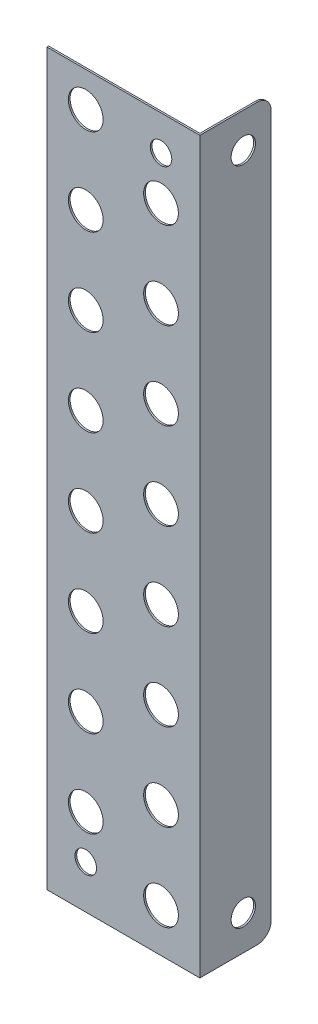
ISO-10303-21;
HEADER;
FILE_DESCRIPTION(('STEP AP214'),'2;1');
FILE_NAME('part.step','',(''),(''),'','','');
FILE_SCHEMA(('AUTOMOTIVE_DESIGN { 1 0 10303 214 1 1 1 1 }'));
ENDSEC;
DATA;
#1=APPLICATION_CONTEXT('core data for automotive mechanical design processes');
#2=APPLICATION_PROTOCOL_DEFINITION('international standard','automotive_design',2000,#1);
#3=PRODUCT_CONTEXT('',#1,'mechanical');
#4=PRODUCT('Part','Part','',(#3));
#5=PRODUCT_RELATED_PRODUCT_CATEGORY('part','',(#4));
#6=PRODUCT_DEFINITION_FORMATION('','',#4);
#7=PRODUCT_DEFINITION_CONTEXT('part definition',#1,'design');
#8=PRODUCT_DEFINITION('design','',#6,#7);
#9=PRODUCT_DEFINITION_SHAPE('','',#8);
#10=(LENGTH_UNIT() NAMED_UNIT(*) SI_UNIT(.MILLI.,.METRE.));
#11=(NAMED_UNIT(*) PLANE_ANGLE_UNIT() SI_UNIT($,.RADIAN.));
#12=(NAMED_UNIT(*) SI_UNIT($,.STERADIAN.) SOLID_ANGLE_UNIT());
#13=UNCERTAINTY_MEASURE_WITH_UNIT(LENGTH_MEASURE(1.E-05),#10,'distance_accuracy_value','');
#14=(GEOMETRIC_REPRESENTATION_CONTEXT(3) GLOBAL_UNCERTAINTY_ASSIGNED_CONTEXT((#13)) GLOBAL_UNIT_ASSIGNED_CONTEXT((#10,
#11,#12)) REPRESENTATION_CONTEXT('',''));
#15=CARTESIAN_POINT('',(0.,0.,0.));
#16=DIRECTION('',(0.,0.,1.));
#17=DIRECTION('',(1.,0.,0.));
#18=AXIS2_PLACEMENT_3D('',#15,#16,#17);
#19=CARTESIAN_POINT('',(-2.58792718984923,71.031785504095,14.8693221093527));
#20=DIRECTION('',(0.,0.,1.));
#21=DIRECTION('',(1.,0.,0.));
#22=AXIS2_PLACEMENT_3D('',#19,#20,#21);
#23=CYLINDRICAL_SURFACE('',#22,5.);
#24=CARTESIAN_POINT('',(-2.58792718984923,71.031785504095,15.3693221093527));
#25=DIRECTION('',(0.,0.,1.));
#26=DIRECTION('',(1.,0.,0.));
#27=AXIS2_PLACEMENT_3D('',#24,#25,#26);
#28=CIRCLE('',#27,5.);
#29=CARTESIAN_POINT('',(2.41207281015077,71.031785504095,15.3693221093527));
#30=VERTEX_POINT('',#29);
#31=EDGE_CURVE('E108',#30,#30,#28,.T.);
#32=ORIENTED_EDGE('',*,*,#31,.T.);
#33=EDGE_LOOP('',(#32));
#34=FACE_BOUND('',#33,.T.);
#35=CARTESIAN_POINT('',(-2.58792718984923,71.031785504095,14.8693221093527));
#36=DIRECTION('',(0.,0.,-1.));
#37=DIRECTION('',(-1.,0.,0.));
#38=AXIS2_PLACEMENT_3D('',#35,#36,#37);
#39=CIRCLE('',#38,5.);
#40=CARTESIAN_POINT('',(-7.58792718984923,71.031785504095,14.8693221093527));
#41=VERTEX_POINT('',#40);
#42=EDGE_CURVE('E215',#41,#41,#39,.F.);
#43=ORIENTED_EDGE('',*,*,#42,.F.);
#44=EDGE_LOOP('',(#43));
#45=FACE_BOUND('',#44,.T.);
#46=ADVANCED_FACE('F33',(#34,#45),#23,.F.);
#47=CARTESIAN_POINT('',(-24.2385622844602,83.531785504095,14.8693221093527));
#48=DIRECTION('',(0.,0.,1.));
#49=DIRECTION('',(1.,0.,0.));
#50=AXIS2_PLACEMENT_3D('',#47,#48,#49);
#51=CYLINDRICAL_SURFACE('',#50,5.);
#52=CARTESIAN_POINT('',(-24.2385622844602,83.531785504095,15.3693221093527));
#53=DIRECTION('',(0.,0.,1.));
#54=DIRECTION('',(1.,0.,0.));
#55=AXIS2_PLACEMENT_3D('',#52,#53,#54);
#56=CIRCLE('',#55,5.);
#57=CARTESIAN_POINT('',(-19.2385622844602,83.531785504095,15.3693221093527));
#58=VERTEX_POINT('',#57);
#59=EDGE_CURVE('E236',#58,#58,#56,.T.);
#60=ORIENTED_EDGE('',*,*,#59,.T.);
#61=EDGE_LOOP('',(#60));
#62=FACE_BOUND('',#61,.T.);
#63=CARTESIAN_POINT('',(-24.2385622844602,83.531785504095,14.8693221093527));
#64=DIRECTION('',(0.,0.,-1.));
#65=DIRECTION('',(-1.,0.,0.));
#66=AXIS2_PLACEMENT_3D('',#63,#64,#65);
#67=CIRCLE('',#66,5.);
#68=CARTESIAN_POINT('',(-29.2385622844602,83.531785504095,14.8693221093527));
#69=VERTEX_POINT('',#68);
#70=EDGE_CURVE('E212',#69,#69,#67,.F.);
#71=ORIENTED_EDGE('',*,*,#70,.F.);
#72=EDGE_LOOP('',(#71));
#73=FACE_BOUND('',#72,.T.);
#74=ADVANCED_FACE('F245',(#62,#73),#51,.F.);
#75=CARTESIAN_POINT('',(-24.2385622844602,58.531785504095,14.8693221093527));
#76=DIRECTION('',(0.,0.,1.));
#77=DIRECTION('',(1.,0.,0.));
#78=AXIS2_PLACEMENT_3D('',#75,#76,#77);
#79=CYLINDRICAL_SURFACE('',#78,5.);
#80=CARTESIAN_POINT('',(-24.2385622844602,58.531785504095,15.3693221093527));
#81=DIRECTION('',(0.,0.,1.));
#82=DIRECTION('',(1.,0.,0.));
#83=AXIS2_PLACEMENT_3D('',#80,#81,#82);
#84=CIRCLE('',#83,5.);
#85=CARTESIAN_POINT('',(-19.2385622844602,58.531785504095,15.3693221093527));
#86=VERTEX_POINT('',#85);
#87=EDGE_CURVE('E233',#86,#86,#84,.T.);
#88=ORIENTED_EDGE('',*,*,#87,.T.);
#89=EDGE_LOOP('',(#88));
#90=FACE_BOUND('',#89,.T.);
#91=CARTESIAN_POINT('',(-24.2385622844602,58.531785504095,14.8693221093527));
#92=DIRECTION('',(0.,0.,-1.));
#93=DIRECTION('',(-1.,0.,0.));
#94=AXIS2_PLACEMENT_3D('',#91,#92,#93);
#95=CIRCLE('',#94,5.);
#96=CARTESIAN_POINT('',(-29.2385622844602,58.531785504095,14.8693221093527));
#97=VERTEX_POINT('',#96);
#98=EDGE_CURVE('E209',#97,#97,#95,.F.);
#99=ORIENTED_EDGE('',*,*,#98,.F.);
#100=EDGE_LOOP('',(#99));
#101=FACE_BOUND('',#100,.T.);
#102=ADVANCED_FACE('F468',(#90,#101),#79,.F.);
#103=CARTESIAN_POINT('',(-24.2385622844602,33.531785504095,14.8693221093527));
#104=DIRECTION('',(0.,0.,1.));
#105=DIRECTION('',(1.,0.,0.));
#106=AXIS2_PLACEMENT_3D('',#103,#104,#105);
#107=CYLINDRICAL_SURFACE('',#106,5.);
#108=CARTESIAN_POINT('',(-24.2385622844602,33.531785504095,15.3693221093527));
#109=DIRECTION('',(0.,0.,1.));
#110=DIRECTION('',(1.,0.,0.));
#111=AXIS2_PLACEMENT_3D('',#108,#109,#110);
#112=CIRCLE('',#111,5.);
#113=CARTESIAN_POINT('',(-19.2385622844602,33.531785504095,15.3693221093527));
#114=VERTEX_POINT('',#113);
#115=EDGE_CURVE('E117',#114,#114,#112,.T.);
#116=ORIENTED_EDGE('',*,*,#115,.T.);
#117=EDGE_LOOP('',(#116));
#118=FACE_BOUND('',#117,.T.);
#119=CARTESIAN_POINT('',(-24.2385622844602,33.531785504095,14.8693221093527));
#120=DIRECTION('',(0.,0.,-1.));
#121=DIRECTION('',(-1.,0.,0.));
#122=AXIS2_PLACEMENT_3D('',#119,#120,#121);
#123=CIRCLE('',#122,5.);
#124=CARTESIAN_POINT('',(-29.2385622844602,33.531785504095,14.8693221093527));
#125=VERTEX_POINT('',#124);
#126=EDGE_CURVE('E206',#125,#125,#123,.F.);
#127=ORIENTED_EDGE('',*,*,#126,.F.);
#128=EDGE_LOOP('',(#127));
#129=FACE_BOUND('',#128,.T.);
#130=ADVANCED_FACE('F479',(#118,#129),#107,.F.);
#131=CARTESIAN_POINT('',(-24.2385622844602,8.53178550409502,14.8693221093527));
#132=DIRECTION('',(0.,0.,1.));
#133=DIRECTION('',(1.,0.,0.));
#134=AXIS2_PLACEMENT_3D('',#131,#132,#133);
#135=CYLINDRICAL_SURFACE('',#134,5.);
#136=CARTESIAN_POINT('',(-24.2385622844602,8.53178550409502,15.3693221093527));
#137=DIRECTION('',(0.,0.,1.));
#138=DIRECTION('',(1.,0.,0.));
#139=AXIS2_PLACEMENT_3D('',#136,#137,#138);
#140=CIRCLE('',#139,5.);
#141=CARTESIAN_POINT('',(-19.2385622844602,8.53178550409502,15.3693221093527));
#142=VERTEX_POINT('',#141);
#143=EDGE_CURVE('E120',#142,#142,#140,.T.);
#144=ORIENTED_EDGE('',*,*,#143,.T.);
#145=EDGE_LOOP('',(#144));
#146=FACE_BOUND('',#145,.T.);
#147=CARTESIAN_POINT('',(-24.2385622844602,8.53178550409502,14.8693221093527));
#148=DIRECTION('',(0.,0.,-1.));
#149=DIRECTION('',(-1.,0.,0.));
#150=AXIS2_PLACEMENT_3D('',#147,#148,#149);
#151=CIRCLE('',#150,5.);
#152=CARTESIAN_POINT('',(-29.2385622844602,8.53178550409502,14.8693221093527));
#153=VERTEX_POINT('',#152);
#154=EDGE_CURVE('E203',#153,#153,#151,.F.);
#155=ORIENTED_EDGE('',*,*,#154,.F.);
#156=EDGE_LOOP('',(#155));
#157=FACE_BOUND('',#156,.T.);
#158=ADVANCED_FACE('F490',(#146,#157),#135,.F.);
#159=CARTESIAN_POINT('',(-24.2385622844602,-16.468214495905,14.8693221093527));
#160=DIRECTION('',(0.,0.,1.));
#161=DIRECTION('',(1.,0.,0.));
#162=AXIS2_PLACEMENT_3D('',#159,#160,#161);
#163=CYLINDRICAL_SURFACE('',#162,5.);
#164=CARTESIAN_POINT('',(-24.2385622844602,-16.468214495905,15.3693221093527));
#165=DIRECTION('',(0.,0.,1.));
#166=DIRECTION('',(1.,0.,0.));
#167=AXIS2_PLACEMENT_3D('',#164,#165,#166);
#168=CIRCLE('',#167,5.);
#169=CARTESIAN_POINT('',(-19.2385622844602,-16.468214495905,15.3693221093527));
#170=VERTEX_POINT('',#169);
#171=EDGE_CURVE('E123',#170,#170,#168,.T.);
#172=ORIENTED_EDGE('',*,*,#171,.T.);
#173=EDGE_LOOP('',(#172));
#174=FACE_BOUND('',#173,.T.);
#175=CARTESIAN_POINT('',(-24.2385622844602,-16.468214495905,14.8693221093527));
#176=DIRECTION('',(0.,0.,-1.));
#177=DIRECTION('',(-1.,0.,0.));
#178=AXIS2_PLACEMENT_3D('',#175,#176,#177);
#179=CIRCLE('',#178,5.);
#180=CARTESIAN_POINT('',(-29.2385622844602,-16.468214495905,14.8693221093527));
#181=VERTEX_POINT('',#180);
#182=EDGE_CURVE('E200',#181,#181,#179,.F.);
#183=ORIENTED_EDGE('',*,*,#182,.F.);
#184=EDGE_LOOP('',(#183));
#185=FACE_BOUND('',#184,.T.);
#186=ADVANCED_FACE('F501',(#174,#185),#163,.F.);
#187=CARTESIAN_POINT('',(-24.2385622844602,-41.468214495905,14.8693221093527));
#188=DIRECTION('',(0.,0.,1.));
#189=DIRECTION('',(1.,0.,0.));
#190=AXIS2_PLACEMENT_3D('',#187,#188,#189);
#191=CYLINDRICAL_SURFACE('',#190,5.);
#192=CARTESIAN_POINT('',(-24.2385622844602,-41.468214495905,15.3693221093527));
#193=DIRECTION('',(0.,0.,1.));
#194=DIRECTION('',(1.,0.,0.));
#195=AXIS2_PLACEMENT_3D('',#192,#193,#194);
#196=CIRCLE('',#195,5.);
#197=CARTESIAN_POINT('',(-19.2385622844602,-41.468214495905,15.3693221093527));
#198=VERTEX_POINT('',#197);
#199=EDGE_CURVE('E126',#198,#198,#196,.T.);
#200=ORIENTED_EDGE('',*,*,#199,.T.);
#201=EDGE_LOOP('',(#200));
#202=FACE_BOUND('',#201,.T.);
#203=CARTESIAN_POINT('',(-24.2385622844602,-41.468214495905,14.8693221093527));
#204=DIRECTION('',(0.,0.,-1.));
#205=DIRECTION('',(-1.,0.,0.));
#206=AXIS2_PLACEMENT_3D('',#203,#204,#205);
#207=CIRCLE('',#206,5.);
#208=CARTESIAN_POINT('',(-29.2385622844602,-41.468214495905,14.8693221093527));
#209=VERTEX_POINT('',#208);
#210=EDGE_CURVE('E197',#209,#209,#207,.F.);
#211=ORIENTED_EDGE('',*,*,#210,.F.);
#212=EDGE_LOOP('',(#211));
#213=FACE_BOUND('',#212,.T.);
#214=ADVANCED_FACE('F295',(#202,#213),#191,.F.);
#215=CARTESIAN_POINT('',(-24.2385622844602,-66.468214495905,14.8693221093527));
#216=DIRECTION('',(0.,0.,1.));
#217=DIRECTION('',(1.,0.,0.));
#218=AXIS2_PLACEMENT_3D('',#215,#216,#217);
#219=CYLINDRICAL_SURFACE('',#218,5.);
#220=CARTESIAN_POINT('',(-24.2385622844602,-66.468214495905,15.3693221093527));
#221=DIRECTION('',(0.,0.,1.));
#222=DIRECTION('',(1.,0.,0.));
#223=AXIS2_PLACEMENT_3D('',#220,#221,#222);
#224=CIRCLE('',#223,5.);
#225=CARTESIAN_POINT('',(-19.2385622844602,-66.468214495905,15.3693221093527));
#226=VERTEX_POINT('',#225);
#227=EDGE_CURVE('E129',#226,#226,#224,.T.);
#228=ORIENTED_EDGE('',*,*,#227,.T.);
#229=EDGE_LOOP('',(#228));
#230=FACE_BOUND('',#229,.T.);
#231=CARTESIAN_POINT('',(-24.2385622844602,-66.468214495905,14.8693221093527));
#232=DIRECTION('',(0.,0.,-1.));
#233=DIRECTION('',(-1.,0.,0.));
#234=AXIS2_PLACEMENT_3D('',#231,#232,#233);
#235=CIRCLE('',#234,5.);
#236=CARTESIAN_POINT('',(-29.2385622844602,-66.468214495905,14.8693221093527));
#237=VERTEX_POINT('',#236);
#238=EDGE_CURVE('E194',#237,#237,#235,.F.);
#239=ORIENTED_EDGE('',*,*,#238,.F.);
#240=EDGE_LOOP('',(#239));
#241=FACE_BOUND('',#240,.T.);
#242=ADVANCED_FACE('F285',(#230,#241),#219,.F.);
#243=CARTESIAN_POINT('',(-24.2385622844602,-91.468214495905,14.8693221093527));
#244=DIRECTION('',(0.,0.,1.));
#245=DIRECTION('',(1.,0.,0.));
#246=AXIS2_PLACEMENT_3D('',#243,#244,#245);
#247=CYLINDRICAL_SURFACE('',#246,5.);
#248=CARTESIAN_POINT('',(-24.2385622844602,-91.468214495905,15.3693221093527));
#249=DIRECTION('',(0.,0.,1.));
#250=DIRECTION('',(1.,0.,0.));
#251=AXIS2_PLACEMENT_3D('',#248,#249,#250);
#252=CIRCLE('',#251,5.);
#253=CARTESIAN_POINT('',(-19.2385622844602,-91.468214495905,15.3693221093527));
#254=VERTEX_POINT('',#253);
#255=EDGE_CURVE('E132',#254,#254,#252,.T.);
#256=ORIENTED_EDGE('',*,*,#255,.T.);
#257=EDGE_LOOP('',(#256));
#258=FACE_BOUND('',#257,.T.);
#259=CARTESIAN_POINT('',(-24.2385622844602,-91.468214495905,14.8693221093527));
#260=DIRECTION('',(0.,0.,-1.));
#261=DIRECTION('',(-1.,0.,0.));
#262=AXIS2_PLACEMENT_3D('',#259,#260,#261);
#263=CIRCLE('',#262,5.);
#264=CARTESIAN_POINT('',(-29.2385622844602,-91.468214495905,14.8693221093527));
#265=VERTEX_POINT('',#264);
#266=EDGE_CURVE('E191',#265,#265,#263,.F.);
#267=ORIENTED_EDGE('',*,*,#266,.F.);
#268=EDGE_LOOP('',(#267));
#269=FACE_BOUND('',#268,.T.);
#270=ADVANCED_FACE('F282',(#258,#269),#247,.F.);
#271=CARTESIAN_POINT('',(-2.58792718984923,46.031785504095,14.8693221093527));
#272=DIRECTION('',(0.,0.,1.));
#273=DIRECTION('',(1.,0.,0.));
#274=AXIS2_PLACEMENT_3D('',#271,#272,#273);
#275=CYLINDRICAL_SURFACE('',#274,5.);
#276=CARTESIAN_POINT('',(-2.58792718984923,46.031785504095,15.3693221093527));
#277=DIRECTION('',(0.,0.,1.));
#278=DIRECTION('',(1.,0.,0.));
#279=AXIS2_PLACEMENT_3D('',#276,#277,#278);
#280=CIRCLE('',#279,5.);
#281=CARTESIAN_POINT('',(2.41207281015077,46.031785504095,15.3693221093527));
#282=VERTEX_POINT('',#281);
#283=EDGE_CURVE('E228',#282,#282,#280,.T.);
#284=ORIENTED_EDGE('',*,*,#283,.T.);
#285=EDGE_LOOP('',(#284));
#286=FACE_BOUND('',#285,.T.);
#287=CARTESIAN_POINT('',(-2.58792718984923,46.031785504095,14.8693221093527));
#288=DIRECTION('',(0.,0.,-1.));
#289=DIRECTION('',(-1.,0.,0.));
#290=AXIS2_PLACEMENT_3D('',#287,#288,#289);
#291=CIRCLE('',#290,5.);
#292=CARTESIAN_POINT('',(-7.58792718984923,46.031785504095,14.8693221093527));
#293=VERTEX_POINT('',#292);
#294=EDGE_CURVE('E188',#293,#293,#291,.F.);
#295=ORIENTED_EDGE('',*,*,#294,.F.);
#296=EDGE_LOOP('',(#295));
#297=FACE_BOUND('',#296,.T.);
#298=ADVANCED_FACE('F284',(#286,#297),#275,.F.);
#299=CARTESIAN_POINT('',(-2.58792718984923,21.031785504095,14.8693221093527));
#300=DIRECTION('',(0.,0.,1.));
#301=DIRECTION('',(1.,0.,0.));
#302=AXIS2_PLACEMENT_3D('',#299,#300,#301);
#303=CYLINDRICAL_SURFACE('',#302,5.);
#304=CARTESIAN_POINT('',(-2.58792718984923,21.031785504095,15.3693221093527));
#305=DIRECTION('',(0.,0.,1.));
#306=DIRECTION('',(1.,0.,0.));
#307=AXIS2_PLACEMENT_3D('',#304,#305,#306);
#308=CIRCLE('',#307,5.);
#309=CARTESIAN_POINT('',(2.41207281015077,21.031785504095,15.3693221093527));
#310=VERTEX_POINT('',#309);
#311=EDGE_CURVE('E135',#310,#310,#308,.T.);
#312=ORIENTED_EDGE('',*,*,#311,.T.);
#313=EDGE_LOOP('',(#312));
#314=FACE_BOUND('',#313,.T.);
#315=CARTESIAN_POINT('',(-2.58792718984923,21.031785504095,14.8693221093527));
#316=DIRECTION('',(0.,0.,-1.));
#317=DIRECTION('',(-1.,0.,0.));
#318=AXIS2_PLACEMENT_3D('',#315,#316,#317);
#319=CIRCLE('',#318,5.);
#320=CARTESIAN_POINT('',(-7.58792718984923,21.031785504095,14.8693221093527));
#321=VERTEX_POINT('',#320);
#322=EDGE_CURVE('E185',#321,#321,#319,.F.);
#323=ORIENTED_EDGE('',*,*,#322,.F.);
#324=EDGE_LOOP('',(#323));
#325=FACE_BOUND('',#324,.T.);
#326=ADVANCED_FACE('F292',(#314,#325),#303,.F.);
#327=CARTESIAN_POINT('',(-2.58792718984923,-3.96821449590497,14.8693221093527));
#328=DIRECTION('',(0.,0.,1.));
#329=DIRECTION('',(1.,0.,0.));
#330=AXIS2_PLACEMENT_3D('',#327,#328,#329);
#331=CYLINDRICAL_SURFACE('',#330,5.);
#332=CARTESIAN_POINT('',(-2.58792718984923,-3.96821449590497,15.3693221093527));
#333=DIRECTION('',(0.,0.,1.));
#334=DIRECTION('',(1.,0.,0.));
#335=AXIS2_PLACEMENT_3D('',#332,#333,#334);
#336=CIRCLE('',#335,5.);
#337=CARTESIAN_POINT('',(2.41207281015077,-3.96821449590497,15.3693221093527));
#338=VERTEX_POINT('',#337);
#339=EDGE_CURVE('E138',#338,#338,#336,.T.);
#340=ORIENTED_EDGE('',*,*,#339,.T.);
#341=EDGE_LOOP('',(#340));
#342=FACE_BOUND('',#341,.T.);
#343=CARTESIAN_POINT('',(-2.58792718984923,-3.96821449590497,14.8693221093527));
#344=DIRECTION('',(0.,0.,-1.));
#345=DIRECTION('',(-1.,0.,0.));
#346=AXIS2_PLACEMENT_3D('',#343,#344,#345);
#347=CIRCLE('',#346,5.);
#348=CARTESIAN_POINT('',(-7.58792718984923,-3.96821449590497,14.8693221093527));
#349=VERTEX_POINT('',#348);
#350=EDGE_CURVE('E182',#349,#349,#347,.F.);
#351=ORIENTED_EDGE('',*,*,#350,.F.);
#352=EDGE_LOOP('',(#351));
#353=FACE_BOUND('',#352,.T.);
#354=ADVANCED_FACE('F302',(#342,#353),#331,.F.);
#355=CARTESIAN_POINT('',(-2.58792718984923,-28.968214495905,14.8693221093527));
#356=DIRECTION('',(0.,0.,1.));
#357=DIRECTION('',(1.,0.,0.));
#358=AXIS2_PLACEMENT_3D('',#355,#356,#357);
#359=CYLINDRICAL_SURFACE('',#358,5.);
#360=CARTESIAN_POINT('',(-2.58792718984923,-28.968214495905,15.3693221093527));
#361=DIRECTION('',(0.,0.,1.));
#362=DIRECTION('',(1.,0.,0.));
#363=AXIS2_PLACEMENT_3D('',#360,#361,#362);
#364=CIRCLE('',#363,5.);
#365=CARTESIAN_POINT('',(2.41207281015077,-28.968214495905,15.3693221093527));
#366=VERTEX_POINT('',#365);
#367=EDGE_CURVE('E141',#366,#366,#364,.T.);
#368=ORIENTED_EDGE('',*,*,#367,.T.);
#369=EDGE_LOOP('',(#368));
#370=FACE_BOUND('',#369,.T.);
#371=CARTESIAN_POINT('',(-2.58792718984923,-28.968214495905,14.8693221093527));
#372=DIRECTION('',(0.,0.,-1.));
#373=DIRECTION('',(-1.,0.,0.));
#374=AXIS2_PLACEMENT_3D('',#371,#372,#373);
#375=CIRCLE('',#374,5.);
#376=CARTESIAN_POINT('',(-7.58792718984923,-28.968214495905,14.8693221093527));
#377=VERTEX_POINT('',#376);
#378=EDGE_CURVE('E179',#377,#377,#375,.F.);
#379=ORIENTED_EDGE('',*,*,#378,.F.);
#380=EDGE_LOOP('',(#379));
#381=FACE_BOUND('',#380,.T.);
#382=ADVANCED_FACE('F306',(#370,#381),#359,.F.);
#383=CARTESIAN_POINT('',(-2.58792718984923,-53.968214495905,14.8693221093527));
#384=DIRECTION('',(0.,0.,1.));
#385=DIRECTION('',(1.,0.,0.));
#386=AXIS2_PLACEMENT_3D('',#383,#384,#385);
#387=CYLINDRICAL_SURFACE('',#386,5.);
#388=CARTESIAN_POINT('',(-2.58792718984923,-53.968214495905,15.3693221093527));
#389=DIRECTION('',(0.,0.,1.));
#390=DIRECTION('',(1.,0.,0.));
#391=AXIS2_PLACEMENT_3D('',#388,#389,#390);
#392=CIRCLE('',#391,5.);
#393=CARTESIAN_POINT('',(2.41207281015077,-53.968214495905,15.3693221093527));
#394=VERTEX_POINT('',#393);
#395=EDGE_CURVE('E144',#394,#394,#392,.T.);
#396=ORIENTED_EDGE('',*,*,#395,.T.);
#397=EDGE_LOOP('',(#396));
#398=FACE_BOUND('',#397,.T.);
#399=CARTESIAN_POINT('',(-2.58792718984923,-53.968214495905,14.8693221093527));
#400=DIRECTION('',(0.,0.,-1.));
#401=DIRECTION('',(-1.,0.,0.));
#402=AXIS2_PLACEMENT_3D('',#399,#400,#401);
#403=CIRCLE('',#402,5.);
#404=CARTESIAN_POINT('',(-7.58792718984923,-53.968214495905,14.8693221093527));
#405=VERTEX_POINT('',#404);
#406=EDGE_CURVE('E171',#405,#405,#403,.F.);
#407=ORIENTED_EDGE('',*,*,#406,.F.);
#408=EDGE_LOOP('',(#407));
#409=FACE_BOUND('',#408,.T.);
#410=ADVANCED_FACE('F310',(#398,#409),#387,.F.);
#411=CARTESIAN_POINT('',(-2.58792718984923,-78.968214495905,14.8693221093527));
#412=DIRECTION('',(0.,0.,1.));
#413=DIRECTION('',(1.,0.,0.));
#414=AXIS2_PLACEMENT_3D('',#411,#412,#413);
#415=CYLINDRICAL_SURFACE('',#414,5.);
#416=CARTESIAN_POINT('',(-2.58792718984923,-78.968214495905,15.3693221093527));
#417=DIRECTION('',(0.,0.,1.));
#418=DIRECTION('',(1.,0.,0.));
#419=AXIS2_PLACEMENT_3D('',#416,#417,#418);
#420=CIRCLE('',#419,5.);
#421=CARTESIAN_POINT('',(2.41207281015077,-78.968214495905,15.3693221093527));
#422=VERTEX_POINT('',#421);
#423=EDGE_CURVE('E42',#422,#422,#420,.T.);
#424=ORIENTED_EDGE('',*,*,#423,.T.);
#425=EDGE_LOOP('',(#424));
#426=FACE_BOUND('',#425,.T.);
#427=CARTESIAN_POINT('',(-2.58792718984923,-78.968214495905,14.8693221093527));
#428=DIRECTION('',(0.,0.,-1.));
#429=DIRECTION('',(-1.,0.,0.));
#430=AXIS2_PLACEMENT_3D('',#427,#428,#429);
#431=CIRCLE('',#430,5.);
#432=CARTESIAN_POINT('',(-7.58792718984923,-78.968214495905,14.8693221093527));
#433=VERTEX_POINT('',#432);
#434=EDGE_CURVE('E167',#433,#433,#431,.F.);
#435=ORIENTED_EDGE('',*,*,#434,.F.);
#436=EDGE_LOOP('',(#435));
#437=FACE_BOUND('',#436,.T.);
#438=ADVANCED_FACE('F149',(#426,#437),#415,.F.);
#439=CARTESIAN_POINT('',(-2.58792718984923,-103.968214495905,14.8693221093527));
#440=DIRECTION('',(0.,0.,1.));
#441=DIRECTION('',(1.,0.,0.));
#442=AXIS2_PLACEMENT_3D('',#439,#440,#441);
#443=CYLINDRICAL_SURFACE('',#442,5.);
#444=CARTESIAN_POINT('',(-2.58792718984923,-103.968214495905,15.3693221093527));
#445=DIRECTION('',(0.,0.,1.));
#446=DIRECTION('',(1.,0.,0.));
#447=AXIS2_PLACEMENT_3D('',#444,#445,#446);
#448=CIRCLE('',#447,5.);
#449=CARTESIAN_POINT('',(2.41207281015077,-103.968214495905,15.3693221093527));
#450=VERTEX_POINT('',#449);
#451=EDGE_CURVE('E11',#450,#450,#448,.T.);
#452=ORIENTED_EDGE('',*,*,#451,.T.);
#453=EDGE_LOOP('',(#452));
#454=FACE_BOUND('',#453,.T.);
#455=CARTESIAN_POINT('',(-2.58792718984923,-103.968214495905,14.8693221093527));
#456=DIRECTION('',(0.,0.,-1.));
#457=DIRECTION('',(-1.,0.,0.));
#458=AXIS2_PLACEMENT_3D('',#455,#456,#457);
#459=CIRCLE('',#458,5.);
#460=CARTESIAN_POINT('',(-7.58792718984923,-103.968214495905,14.8693221093527));
#461=VERTEX_POINT('',#460);
#462=EDGE_CURVE('E165',#461,#461,#459,.F.);
#463=ORIENTED_EDGE('',*,*,#462,.F.);
#464=EDGE_LOOP('',(#463));
#465=FACE_BOUND('',#464,.T.);
#466=ADVANCED_FACE('F35',(#454,#465),#443,.F.);
#467=CARTESIAN_POINT('',(-13.4132447371547,-11.468214495905,14.8693221093527));
#468=DIRECTION('',(0.,0.,-1.));
#469=DIRECTION('',(-1.,0.,0.));
#470=AXIS2_PLACEMENT_3D('',#467,#468,#469);
#471=PLANE('',#470);
#472=DIRECTION('',(0.,1.,0.));
#473=VECTOR('',#472,1.);
#474=CARTESIAN_POINT('',(8.08675526284528,-11.468214495905,14.8693221093527));
#475=LINE('',#474,#473);
#476=CARTESIAN_POINT('',(8.08675526284528,-116.468214495905,14.8693221093527));
#477=VERTEX_POINT('',#476);
#478=CARTESIAN_POINT('',(8.08675526284528,93.531785504095,14.8693221093527));
#479=VERTEX_POINT('',#478);
#480=EDGE_CURVE('E168',#477,#479,#475,.T.);
#481=ORIENTED_EDGE('',*,*,#480,.F.);
#482=DIRECTION('',(1.,0.,0.));
#483=VECTOR('',#482,1.);
#484=CARTESIAN_POINT('',(-35.4132447371547,-116.468214495905,14.8693221093527));
#485=LINE('',#484,#483);
#486=CARTESIAN_POINT('',(-35.4132447371547,-116.468214495905,14.8693221093527));
#487=VERTEX_POINT('',#486);
#488=EDGE_CURVE('E110',#487,#477,#485,.T.);
#489=ORIENTED_EDGE('',*,*,#488,.F.);
#490=DIRECTION('',(0.,-1.,0.));
#491=VECTOR('',#490,1.);
#492=CARTESIAN_POINT('',(-35.4132447371547,-116.468214495905,14.8693221093527));
#493=LINE('',#492,#491);
#494=CARTESIAN_POINT('',(-35.4132447371547,93.531785504095,14.8693221093527));
#495=VERTEX_POINT('',#494);
#496=EDGE_CURVE('E107',#495,#487,#493,.T.);
#497=ORIENTED_EDGE('',*,*,#496,.F.);
#498=DIRECTION('',(-1.,0.,0.));
#499=VECTOR('',#498,1.);
#500=CARTESIAN_POINT('',(-35.4132447371547,93.531785504095,14.8693221093527));
#501=LINE('',#500,#499);
#502=EDGE_CURVE('E62',#479,#495,#501,.T.);
#503=ORIENTED_EDGE('',*,*,#502,.F.);
#504=EDGE_LOOP('',(#481,#489,#497,#503));
#505=FACE_BOUND('',#504,.T.);
#506=CARTESIAN_POINT('',(-24.2385622844602,-103.968214495905,14.8693221093527));
#507=DIRECTION('',(0.,0.,-1.));
#508=DIRECTION('',(-1.,0.,0.));
#509=AXIS2_PLACEMENT_3D('',#506,#507,#508);
#510=CIRCLE('',#509,3.1);
#511=CARTESIAN_POINT('',(-27.3385622844602,-103.968214495905,14.8693221093527));
#512=VERTEX_POINT('',#511);
#513=EDGE_CURVE('E218',#512,#512,#510,.T.);
#514=ORIENTED_EDGE('',*,*,#513,.F.);
#515=EDGE_LOOP('',(#514));
#516=FACE_BOUND('',#515,.T.);
#517=CARTESIAN_POINT('',(-2.58792718984923,83.5317855040951,14.8693221093527));
#518=DIRECTION('',(0.,0.,-1.));
#519=DIRECTION('',(-1.,0.,0.));
#520=AXIS2_PLACEMENT_3D('',#517,#518,#519);
#521=CIRCLE('',#520,3.1);
#522=CARTESIAN_POINT('',(-5.68792718984923,83.5317855040951,14.8693221093527));
#523=VERTEX_POINT('',#522);
#524=EDGE_CURVE('E222',#523,#523,#521,.T.);
#525=ORIENTED_EDGE('',*,*,#524,.F.);
#526=EDGE_LOOP('',(#525));
#527=FACE_BOUND('',#526,.T.);
#528=ORIENTED_EDGE('',*,*,#42,.T.);
#529=EDGE_LOOP('',(#528));
#530=FACE_BOUND('',#529,.T.);
#531=ORIENTED_EDGE('',*,*,#70,.T.);
#532=EDGE_LOOP('',(#531));
#533=FACE_BOUND('',#532,.T.);
#534=ORIENTED_EDGE('',*,*,#294,.T.);
#535=EDGE_LOOP('',(#534));
#536=FACE_BOUND('',#535,.T.);
#537=ORIENTED_EDGE('',*,*,#98,.T.);
#538=EDGE_LOOP('',(#537));
#539=FACE_BOUND('',#538,.T.);
#540=ORIENTED_EDGE('',*,*,#322,.T.);
#541=EDGE_LOOP('',(#540));
#542=FACE_BOUND('',#541,.T.);
#543=ORIENTED_EDGE('',*,*,#126,.T.);
#544=EDGE_LOOP('',(#543));
#545=FACE_BOUND('',#544,.T.);
#546=ORIENTED_EDGE('',*,*,#350,.T.);
#547=EDGE_LOOP('',(#546));
#548=FACE_BOUND('',#547,.T.);
#549=ORIENTED_EDGE('',*,*,#154,.T.);
#550=EDGE_LOOP('',(#549));
#551=FACE_BOUND('',#550,.T.);
#552=ORIENTED_EDGE('',*,*,#378,.T.);
#553=EDGE_LOOP('',(#552));
#554=FACE_BOUND('',#553,.T.);
#555=ORIENTED_EDGE('',*,*,#182,.T.);
#556=EDGE_LOOP('',(#555));
#557=FACE_BOUND('',#556,.T.);
#558=ORIENTED_EDGE('',*,*,#406,.T.);
#559=EDGE_LOOP('',(#558));
#560=FACE_BOUND('',#559,.T.);
#561=ORIENTED_EDGE('',*,*,#210,.T.);
#562=EDGE_LOOP('',(#561));
#563=FACE_BOUND('',#562,.T.);
#564=ORIENTED_EDGE('',*,*,#434,.T.);
#565=EDGE_LOOP('',(#564));
#566=FACE_BOUND('',#565,.T.);
#567=ORIENTED_EDGE('',*,*,#238,.T.);
#568=EDGE_LOOP('',(#567));
#569=FACE_BOUND('',#568,.T.);
#570=ORIENTED_EDGE('',*,*,#462,.T.);
#571=EDGE_LOOP('',(#570));
#572=FACE_BOUND('',#571,.T.);
#573=ORIENTED_EDGE('',*,*,#266,.T.);
#574=EDGE_LOOP('',(#573));
#575=FACE_BOUND('',#574,.T.);
#576=ADVANCED_FACE('F162',(#505,#516,#527,#530,#533,#536,#539,#542,#545,#548,#551,#554,#557,
#560,#563,#566,#569,#572,#575),#471,.T.);
#577=CARTESIAN_POINT('',(8.58675526284528,-116.468214495905,15.3693221093527));
#578=DIRECTION('',(-1.,0.,0.));
#579=DIRECTION('',(0.,0.,1.));
#580=AXIS2_PLACEMENT_3D('',#577,#578,#579);
#581=PLANE('',#580);
#582=DIRECTION('',(0.,0.,-1.));
#583=VECTOR('',#582,1.);
#584=CARTESIAN_POINT('',(8.58675526284528,-116.468214495905,15.3693221093527));
#585=LINE('',#584,#583);
#586=CARTESIAN_POINT('',(8.58675526284528,-116.468214495905,15.3693221093527));
#587=VERTEX_POINT('',#586);
#588=CARTESIAN_POINT('',(8.58675526284528,-116.468214495905,-1.13067789064725));
#589=VERTEX_POINT('',#588);
#590=EDGE_CURVE('E102',#587,#589,#585,.T.);
#591=ORIENTED_EDGE('',*,*,#590,.T.);
#592=CARTESIAN_POINT('',(8.58675526284528,-112.468214495905,-1.13067789064727));
#593=DIRECTION('',(1.,0.,0.));
#594=DIRECTION('',(0.,0.,-1.));
#595=AXIS2_PLACEMENT_3D('',#592,#593,#594);
#596=CIRCLE('',#595,4.);
#597=CARTESIAN_POINT('',(8.58675526284528,-112.468214495905,-5.13067789064728));
#598=VERTEX_POINT('',#597);
#599=EDGE_CURVE('E664',#589,#598,#596,.T.);
#600=ORIENTED_EDGE('',*,*,#599,.T.);
#601=DIRECTION('',(0.,1.,0.));
#602=VECTOR('',#601,1.);
#603=CARTESIAN_POINT('',(8.58675526284528,-112.468214495905,-5.13067789064727));
#604=LINE('',#603,#602);
#605=CARTESIAN_POINT('',(8.58675526284528,89.531785504095,-5.13067789064727));
#606=VERTEX_POINT('',#605);
#607=EDGE_CURVE('E683',#598,#606,#604,.T.);
#608=ORIENTED_EDGE('',*,*,#607,.T.);
#609=CARTESIAN_POINT('',(8.58675526284528,89.531785504095,-1.13067789064727));
#610=DIRECTION('',(1.,0.,0.));
#611=DIRECTION('',(0.,0.,1.));
#612=AXIS2_PLACEMENT_3D('',#609,#610,#611);
#613=CIRCLE('',#612,4.);
#614=CARTESIAN_POINT('',(8.58675526284528,93.531785504095,-1.13067789064725));
#615=VERTEX_POINT('',#614);
#616=EDGE_CURVE('E669',#606,#615,#613,.T.);
#617=ORIENTED_EDGE('',*,*,#616,.T.);
#618=DIRECTION('',(0.,0.,-1.));
#619=VECTOR('',#618,1.);
#620=CARTESIAN_POINT('',(8.58675526284528,93.531785504095,15.3693221093527));
#621=LINE('',#620,#619);
#622=CARTESIAN_POINT('',(8.58675526284528,93.531785504095,15.3693221093527));
#623=VERTEX_POINT('',#622);
#624=EDGE_CURVE('E96',#623,#615,#621,.T.);
#625=ORIENTED_EDGE('',*,*,#624,.F.);
#626=DIRECTION('',(0.,1.,0.));
#627=VECTOR('',#626,1.);
#628=CARTESIAN_POINT('',(8.58675526284528,-116.468214495905,15.3693221093527));
#629=LINE('',#628,#627);
#630=EDGE_CURVE('E88',#587,#623,#629,.T.);
#631=ORIENTED_EDGE('',*,*,#630,.F.);
#632=EDGE_LOOP('',(#591,#600,#608,#617,#625,#631));
#633=FACE_BOUND('',#632,.T.);
#634=CARTESIAN_POINT('',(8.58675526284528,83.5317855040879,2.86932210935019));
#635=DIRECTION('',(1.,0.,0.));
#636=DIRECTION('',(0.,0.,1.));
#637=AXIS2_PLACEMENT_3D('',#634,#635,#636);
#638=CIRCLE('',#637,3.5);
#639=CARTESIAN_POINT('',(8.58675526284528,83.5317855040879,6.36932210935019));
#640=VERTEX_POINT('',#639);
#641=EDGE_CURVE('E655',#640,#640,#638,.T.);
#642=ORIENTED_EDGE('',*,*,#641,.F.);
#643=EDGE_LOOP('',(#642));
#644=FACE_BOUND('',#643,.T.);
#645=CARTESIAN_POINT('',(8.58675526284528,-106.468214495898,2.86932210935019));
#646=DIRECTION('',(1.,0.,0.));
#647=DIRECTION('',(0.,0.,-1.));
#648=AXIS2_PLACEMENT_3D('',#645,#646,#647);
#649=CIRCLE('',#648,3.5);
#650=CARTESIAN_POINT('',(8.58675526284528,-106.468214495898,-0.630677890649813));
#651=VERTEX_POINT('',#650);
#652=EDGE_CURVE('E658',#651,#651,#649,.T.);
#653=ORIENTED_EDGE('',*,*,#652,.F.);
#654=EDGE_LOOP('',(#653));
#655=FACE_BOUND('',#654,.T.);
#656=ADVANCED_FACE('F251',(#633,#644,#655),#581,.F.);
#657=CARTESIAN_POINT('',(-35.4132447371547,93.531785504095,15.3693221093527));
#658=DIRECTION('',(0.,-1.,0.));
#659=DIRECTION('',(0.,0.,-1.));
#660=AXIS2_PLACEMENT_3D('',#657,#658,#659);
#661=PLANE('',#660);
#662=DIRECTION('',(0.,0.,-1.));
#663=VECTOR('',#662,1.);
#664=CARTESIAN_POINT('',(-35.4132447371547,93.531785504095,15.3693221093527));
#665=LINE('',#664,#663);
#666=CARTESIAN_POINT('',(-35.4132447371547,93.531785504095,15.3693221093527));
#667=VERTEX_POINT('',#666);
#668=EDGE_CURVE('E92',#667,#495,#665,.T.);
#669=ORIENTED_EDGE('',*,*,#668,.F.);
#670=DIRECTION('',(-1.,0.,0.));
#671=VECTOR('',#670,1.);
#672=CARTESIAN_POINT('',(-35.4132447371547,93.531785504095,15.3693221093527));
#673=LINE('',#672,#671);
#674=EDGE_CURVE('E81',#623,#667,#673,.T.);
#675=ORIENTED_EDGE('',*,*,#674,.F.);
#676=ORIENTED_EDGE('',*,*,#624,.T.);
#677=DIRECTION('',(1.,0.,0.));
#678=VECTOR('',#677,1.);
#679=CARTESIAN_POINT('',(8.08675526284528,93.531785504095,-1.13067789064725));
#680=LINE('',#679,#678);
#681=CARTESIAN_POINT('',(8.08675526284528,93.531785504095,-1.13067789064725));
#682=VERTEX_POINT('',#681);
#683=EDGE_CURVE('E173',#682,#615,#680,.T.);
#684=ORIENTED_EDGE('',*,*,#683,.F.);
#685=DIRECTION('',(0.,0.,1.));
#686=VECTOR('',#685,1.);
#687=CARTESIAN_POINT('',(8.08675526284528,93.531785504095,15.3693221093527));
#688=LINE('',#687,#686);
#689=EDGE_CURVE('E678',#682,#479,#688,.T.);
#690=ORIENTED_EDGE('',*,*,#689,.T.);
#691=ORIENTED_EDGE('',*,*,#502,.T.);
#692=EDGE_LOOP('',(#669,#675,#676,#684,#690,#691));
#693=FACE_BOUND('',#692,.T.);
#694=ADVANCED_FACE('F93',(#693),#661,.F.);
#695=CARTESIAN_POINT('',(-35.4132447371547,-116.468214495905,15.3693221093527));
#696=DIRECTION('',(1.,0.,0.));
#697=DIRECTION('',(0.,0.,-1.));
#698=AXIS2_PLACEMENT_3D('',#695,#696,#697);
#699=PLANE('',#698);
#700=ORIENTED_EDGE('',*,*,#496,.T.);
#701=DIRECTION('',(0.,0.,-1.));
#702=VECTOR('',#701,1.);
#703=CARTESIAN_POINT('',(-35.4132447371547,-116.468214495905,15.3693221093527));
#704=LINE('',#703,#702);
#705=CARTESIAN_POINT('',(-35.4132447371547,-116.468214495905,15.3693221093527));
#706=VERTEX_POINT('',#705);
#707=EDGE_CURVE('E97',#706,#487,#704,.T.);
#708=ORIENTED_EDGE('',*,*,#707,.F.);
#709=DIRECTION('',(0.,-1.,0.));
#710=VECTOR('',#709,1.);
#711=CARTESIAN_POINT('',(-35.4132447371547,-116.468214495905,15.3693221093527));
#712=LINE('',#711,#710);
#713=EDGE_CURVE('E85',#667,#706,#712,.T.);
#714=ORIENTED_EDGE('',*,*,#713,.F.);
#715=ORIENTED_EDGE('',*,*,#668,.T.);
#716=EDGE_LOOP('',(#700,#708,#714,#715));
#717=FACE_BOUND('',#716,.T.);
#718=ADVANCED_FACE('F99',(#717),#699,.F.);
#719=CARTESIAN_POINT('',(-35.4132447371547,-116.468214495905,15.3693221093527));
#720=DIRECTION('',(0.,1.,0.));
#721=DIRECTION('',(0.,0.,1.));
#722=AXIS2_PLACEMENT_3D('',#719,#720,#721);
#723=PLANE('',#722);
#724=ORIENTED_EDGE('',*,*,#488,.T.);
#725=DIRECTION('',(0.,0.,-1.));
#726=VECTOR('',#725,1.);
#727=CARTESIAN_POINT('',(8.08675526284528,-116.468214495905,15.3693221093527));
#728=LINE('',#727,#726);
#729=CARTESIAN_POINT('',(8.08675526284528,-116.468214495905,-1.13067789064725));
#730=VERTEX_POINT('',#729);
#731=EDGE_CURVE('E73',#477,#730,#728,.T.);
#732=ORIENTED_EDGE('',*,*,#731,.T.);
#733=DIRECTION('',(1.,0.,0.));
#734=VECTOR('',#733,1.);
#735=CARTESIAN_POINT('',(8.08675526284528,-116.468214495905,-1.13067789064725));
#736=LINE('',#735,#734);
#737=EDGE_CURVE('E680',#730,#589,#736,.T.);
#738=ORIENTED_EDGE('',*,*,#737,.T.);
#739=ORIENTED_EDGE('',*,*,#590,.F.);
#740=DIRECTION('',(1.,0.,0.));
#741=VECTOR('',#740,1.);
#742=CARTESIAN_POINT('',(-35.4132447371547,-116.468214495905,15.3693221093527));
#743=LINE('',#742,#741);
#744=EDGE_CURVE('E50',#706,#587,#743,.T.);
#745=ORIENTED_EDGE('',*,*,#744,.F.);
#746=ORIENTED_EDGE('',*,*,#707,.T.);
#747=EDGE_LOOP('',(#724,#732,#738,#739,#745,#746));
#748=FACE_BOUND('',#747,.T.);
#749=ADVANCED_FACE('F155',(#748),#723,.F.);
#750=CARTESIAN_POINT('',(-13.4132447371547,-11.468214495905,15.3693221093527));
#751=DIRECTION('',(0.,0.,-1.));
#752=DIRECTION('',(-1.,0.,0.));
#753=AXIS2_PLACEMENT_3D('',#750,#751,#752);
#754=PLANE('',#753);
#755=CARTESIAN_POINT('',(-24.2385622844602,-103.968214495905,15.3693221093527));
#756=DIRECTION('',(0.,0.,-1.));
#757=DIRECTION('',(-1.,0.,0.));
#758=AXIS2_PLACEMENT_3D('',#755,#756,#757);
#759=CIRCLE('',#758,3.1);
#760=CARTESIAN_POINT('',(-27.3385622844602,-103.968214495905,15.3693221093527));
#761=VERTEX_POINT('',#760);
#762=EDGE_CURVE('E219',#761,#761,#759,.T.);
#763=ORIENTED_EDGE('',*,*,#762,.T.);
#764=EDGE_LOOP('',(#763));
#765=FACE_BOUND('',#764,.T.);
#766=CARTESIAN_POINT('',(-2.58792718984923,83.5317855040951,15.3693221093527));
#767=DIRECTION('',(0.,0.,-1.));
#768=DIRECTION('',(-1.,0.,0.));
#769=AXIS2_PLACEMENT_3D('',#766,#767,#768);
#770=CIRCLE('',#769,3.1);
#771=CARTESIAN_POINT('',(-5.68792718984923,83.5317855040951,15.3693221093527));
#772=VERTEX_POINT('',#771);
#773=EDGE_CURVE('E225',#772,#772,#770,.T.);
#774=ORIENTED_EDGE('',*,*,#773,.T.);
#775=EDGE_LOOP('',(#774));
#776=FACE_BOUND('',#775,.T.);
#777=ORIENTED_EDGE('',*,*,#283,.F.);
#778=EDGE_LOOP('',(#777));
#779=FACE_BOUND('',#778,.T.);
#780=ORIENTED_EDGE('',*,*,#87,.F.);
#781=EDGE_LOOP('',(#780));
#782=FACE_BOUND('',#781,.T.);
#783=ORIENTED_EDGE('',*,*,#59,.F.);
#784=EDGE_LOOP('',(#783));
#785=FACE_BOUND('',#784,.T.);
#786=ORIENTED_EDGE('',*,*,#31,.F.);
#787=EDGE_LOOP('',(#786));
#788=FACE_BOUND('',#787,.T.);
#789=ORIENTED_EDGE('',*,*,#744,.T.);
#790=ORIENTED_EDGE('',*,*,#630,.T.);
#791=ORIENTED_EDGE('',*,*,#674,.T.);
#792=ORIENTED_EDGE('',*,*,#713,.T.);
#793=EDGE_LOOP('',(#789,#790,#791,#792));
#794=FACE_BOUND('',#793,.T.);
#795=ORIENTED_EDGE('',*,*,#115,.F.);
#796=EDGE_LOOP('',(#795));
#797=FACE_BOUND('',#796,.T.);
#798=ORIENTED_EDGE('',*,*,#143,.F.);
#799=EDGE_LOOP('',(#798));
#800=FACE_BOUND('',#799,.T.);
#801=ORIENTED_EDGE('',*,*,#171,.F.);
#802=EDGE_LOOP('',(#801));
#803=FACE_BOUND('',#802,.T.);
#804=ORIENTED_EDGE('',*,*,#199,.F.);
#805=EDGE_LOOP('',(#804));
#806=FACE_BOUND('',#805,.T.);
#807=ORIENTED_EDGE('',*,*,#227,.F.);
#808=EDGE_LOOP('',(#807));
#809=FACE_BOUND('',#808,.T.);
#810=ORIENTED_EDGE('',*,*,#255,.F.);
#811=EDGE_LOOP('',(#810));
#812=FACE_BOUND('',#811,.T.);
#813=ORIENTED_EDGE('',*,*,#311,.F.);
#814=EDGE_LOOP('',(#813));
#815=FACE_BOUND('',#814,.T.);
#816=ORIENTED_EDGE('',*,*,#339,.F.);
#817=EDGE_LOOP('',(#816));
#818=FACE_BOUND('',#817,.T.);
#819=ORIENTED_EDGE('',*,*,#367,.F.);
#820=EDGE_LOOP('',(#819));
#821=FACE_BOUND('',#820,.T.);
#822=ORIENTED_EDGE('',*,*,#395,.F.);
#823=EDGE_LOOP('',(#822));
#824=FACE_BOUND('',#823,.T.);
#825=ORIENTED_EDGE('',*,*,#423,.F.);
#826=EDGE_LOOP('',(#825));
#827=FACE_BOUND('',#826,.T.);
#828=ORIENTED_EDGE('',*,*,#451,.F.);
#829=EDGE_LOOP('',(#828));
#830=FACE_BOUND('',#829,.T.);
#831=ADVANCED_FACE('F82',(#765,#776,#779,#782,#785,#788,#794,#797,#800,#803,#806,#809,#812,#815,
#818,#821,#824,#827,#830),#754,.F.);
#832=CARTESIAN_POINT('',(-2.58792718984923,83.5317855040951,15.3693221093527));
#833=DIRECTION('',(0.,0.,-1.));
#834=DIRECTION('',(-1.,0.,0.));
#835=AXIS2_PLACEMENT_3D('',#832,#833,#834);
#836=CYLINDRICAL_SURFACE('',#835,3.1);
#837=ORIENTED_EDGE('',*,*,#773,.F.);
#838=EDGE_LOOP('',(#837));
#839=FACE_BOUND('',#838,.T.);
#840=ORIENTED_EDGE('',*,*,#524,.T.);
#841=EDGE_LOOP('',(#840));
#842=FACE_BOUND('',#841,.T.);
#843=ADVANCED_FACE('F154',(#839,#842),#836,.F.);
#844=CARTESIAN_POINT('',(-24.2385622844602,-103.968214495905,15.3693221093527));
#845=DIRECTION('',(0.,0.,-1.));
#846=DIRECTION('',(-1.,0.,0.));
#847=AXIS2_PLACEMENT_3D('',#844,#845,#846);
#848=CYLINDRICAL_SURFACE('',#847,3.1);
#849=ORIENTED_EDGE('',*,*,#762,.F.);
#850=EDGE_LOOP('',(#849));
#851=FACE_BOUND('',#850,.T.);
#852=ORIENTED_EDGE('',*,*,#513,.T.);
#853=EDGE_LOOP('',(#852));
#854=FACE_BOUND('',#853,.T.);
#855=ADVANCED_FACE('F364',(#851,#854),#848,.F.);
#856=CARTESIAN_POINT('',(8.08675526284528,89.531785504095,-1.13067789064727));
#857=DIRECTION('',(1.,0.,0.));
#858=DIRECTION('',(0.,0.,-1.));
#859=AXIS2_PLACEMENT_3D('',#856,#857,#858);
#860=CYLINDRICAL_SURFACE('',#859,4.);
#861=ORIENTED_EDGE('',*,*,#616,.F.);
#862=DIRECTION('',(1.,0.,0.));
#863=VECTOR('',#862,1.);
#864=CARTESIAN_POINT('',(8.08675526284528,89.531785504095,-5.13067789064727));
#865=LINE('',#864,#863);
#866=CARTESIAN_POINT('',(8.08675526284528,89.531785504095,-5.13067789064727));
#867=VERTEX_POINT('',#866);
#868=EDGE_CURVE('E690',#867,#606,#865,.T.);
#869=ORIENTED_EDGE('',*,*,#868,.F.);
#870=CARTESIAN_POINT('',(8.08675526284528,89.531785504095,-1.13067789064727));
#871=DIRECTION('',(1.,0.,0.));
#872=DIRECTION('',(0.,0.,1.));
#873=AXIS2_PLACEMENT_3D('',#870,#871,#872);
#874=CIRCLE('',#873,4.);
#875=EDGE_CURVE('E675',#867,#682,#874,.T.);
#876=ORIENTED_EDGE('',*,*,#875,.T.);
#877=ORIENTED_EDGE('',*,*,#683,.T.);
#878=EDGE_LOOP('',(#861,#869,#876,#877));
#879=FACE_BOUND('',#878,.T.);
#880=ADVANCED_FACE('F372',(#879),#860,.T.);
#881=CARTESIAN_POINT('',(8.08675526284528,-112.468214495905,-5.13067789064727));
#882=DIRECTION('',(0.,0.,-1.));
#883=DIRECTION('',(-1.,0.,0.));
#884=AXIS2_PLACEMENT_3D('',#881,#882,#883);
#885=PLANE('',#884);
#886=ORIENTED_EDGE('',*,*,#607,.F.);
#887=DIRECTION('',(1.,0.,0.));
#888=VECTOR('',#887,1.);
#889=CARTESIAN_POINT('',(8.08675526284528,-112.468214495905,-5.13067789064728));
#890=LINE('',#889,#888);
#891=CARTESIAN_POINT('',(8.08675526284528,-112.468214495905,-5.13067789064728));
#892=VERTEX_POINT('',#891);
#893=EDGE_CURVE('E693',#892,#598,#890,.T.);
#894=ORIENTED_EDGE('',*,*,#893,.F.);
#895=DIRECTION('',(0.,1.,0.));
#896=VECTOR('',#895,1.);
#897=CARTESIAN_POINT('',(8.08675526284528,-112.468214495905,-5.13067789064727));
#898=LINE('',#897,#896);
#899=EDGE_CURVE('E672',#892,#867,#898,.T.);
#900=ORIENTED_EDGE('',*,*,#899,.T.);
#901=ORIENTED_EDGE('',*,*,#868,.T.);
#902=EDGE_LOOP('',(#886,#894,#900,#901));
#903=FACE_BOUND('',#902,.T.);
#904=ADVANCED_FACE('F380',(#903),#885,.T.);
#905=CARTESIAN_POINT('',(8.08675526284528,-112.468214495905,-1.13067789064727));
#906=DIRECTION('',(1.,0.,0.));
#907=DIRECTION('',(0.,0.,-1.));
#908=AXIS2_PLACEMENT_3D('',#905,#906,#907);
#909=CYLINDRICAL_SURFACE('',#908,4.);
#910=ORIENTED_EDGE('',*,*,#599,.F.);
#911=ORIENTED_EDGE('',*,*,#737,.F.);
#912=CARTESIAN_POINT('',(8.08675526284528,-112.468214495905,-1.13067789064727));
#913=DIRECTION('',(1.,0.,0.));
#914=DIRECTION('',(0.,0.,-1.));
#915=AXIS2_PLACEMENT_3D('',#912,#913,#914);
#916=CIRCLE('',#915,4.);
#917=EDGE_CURVE('E668',#730,#892,#916,.T.);
#918=ORIENTED_EDGE('',*,*,#917,.T.);
#919=ORIENTED_EDGE('',*,*,#893,.T.);
#920=EDGE_LOOP('',(#910,#911,#918,#919));
#921=FACE_BOUND('',#920,.T.);
#922=ADVANCED_FACE('F388',(#921),#909,.T.);
#923=CARTESIAN_POINT('',(8.08675526284528,89.531785504095,-1.13067789064727));
#924=DIRECTION('',(-1.,0.,0.));
#925=DIRECTION('',(0.,0.,1.));
#926=AXIS2_PLACEMENT_3D('',#923,#924,#925);
#927=PLANE('',#926);
#928=CARTESIAN_POINT('',(8.08675526284528,83.5317855040879,2.86932210935019));
#929=DIRECTION('',(1.,0.,0.));
#930=DIRECTION('',(0.,0.,1.));
#931=AXIS2_PLACEMENT_3D('',#928,#929,#930);
#932=CIRCLE('',#931,3.5);
#933=CARTESIAN_POINT('',(8.08675526284528,83.5317855040879,6.36932210935019));
#934=VERTEX_POINT('',#933);
#935=EDGE_CURVE('E652',#934,#934,#932,.T.);
#936=ORIENTED_EDGE('',*,*,#935,.T.);
#937=EDGE_LOOP('',(#936));
#938=FACE_BOUND('',#937,.T.);
#939=CARTESIAN_POINT('',(8.08675526284528,-106.468214495898,2.86932210935019));
#940=DIRECTION('',(1.,0.,0.));
#941=DIRECTION('',(0.,0.,-1.));
#942=AXIS2_PLACEMENT_3D('',#939,#940,#941);
#943=CIRCLE('',#942,3.5);
#944=CARTESIAN_POINT('',(8.08675526284528,-106.468214495898,-0.630677890649813));
#945=VERTEX_POINT('',#944);
#946=EDGE_CURVE('E661',#945,#945,#943,.T.);
#947=ORIENTED_EDGE('',*,*,#946,.T.);
#948=EDGE_LOOP('',(#947));
#949=FACE_BOUND('',#948,.T.);
#950=ORIENTED_EDGE('',*,*,#731,.F.);
#951=ORIENTED_EDGE('',*,*,#480,.T.);
#952=ORIENTED_EDGE('',*,*,#689,.F.);
#953=ORIENTED_EDGE('',*,*,#875,.F.);
#954=ORIENTED_EDGE('',*,*,#899,.F.);
#955=ORIENTED_EDGE('',*,*,#917,.F.);
#956=EDGE_LOOP('',(#950,#951,#952,#953,#954,#955));
#957=FACE_BOUND('',#956,.T.);
#958=ADVANCED_FACE('F396',(#938,#949,#957),#927,.T.);
#959=CARTESIAN_POINT('',(8.08675526284528,-106.468214495898,2.86932210935019));
#960=DIRECTION('',(1.,0.,0.));
#961=DIRECTION('',(0.,0.,-1.));
#962=AXIS2_PLACEMENT_3D('',#959,#960,#961);
#963=CYLINDRICAL_SURFACE('',#962,3.5);
#964=ORIENTED_EDGE('',*,*,#946,.F.);
#965=EDGE_LOOP('',(#964));
#966=FACE_BOUND('',#965,.T.);
#967=ORIENTED_EDGE('',*,*,#652,.T.);
#968=EDGE_LOOP('',(#967));
#969=FACE_BOUND('',#968,.T.);
#970=ADVANCED_FACE('F404',(#966,#969),#963,.F.);
#971=CARTESIAN_POINT('',(8.08675526284528,83.5317855040879,2.86932210935019));
#972=DIRECTION('',(1.,0.,0.));
#973=DIRECTION('',(0.,0.,-1.));
#974=AXIS2_PLACEMENT_3D('',#971,#972,#973);
#975=CYLINDRICAL_SURFACE('',#974,3.5);
#976=ORIENTED_EDGE('',*,*,#935,.F.);
#977=EDGE_LOOP('',(#976));
#978=FACE_BOUND('',#977,.T.);
#979=ORIENTED_EDGE('',*,*,#641,.T.);
#980=EDGE_LOOP('',(#979));
#981=FACE_BOUND('',#980,.T.);
#982=ADVANCED_FACE('F412',(#978,#981),#975,.F.);
#983=CLOSED_SHELL('',(#46,#74,#102,#130,#158,#186,#214,#242,#270,#298,#326,#354,#382,#410,#438,
#466,#576,#656,#694,#718,#749,#831,#843,#855,#880,#904,#922,#958,#970,#982));
#984=MANIFOLD_SOLID_BREP('B2',#983);
#985=ADVANCED_BREP_SHAPE_REPRESENTATION('',(#18,#984),#14);
#986=SHAPE_DEFINITION_REPRESENTATION(#9,#985);
ENDSEC;
END-ISO-10303-21;
